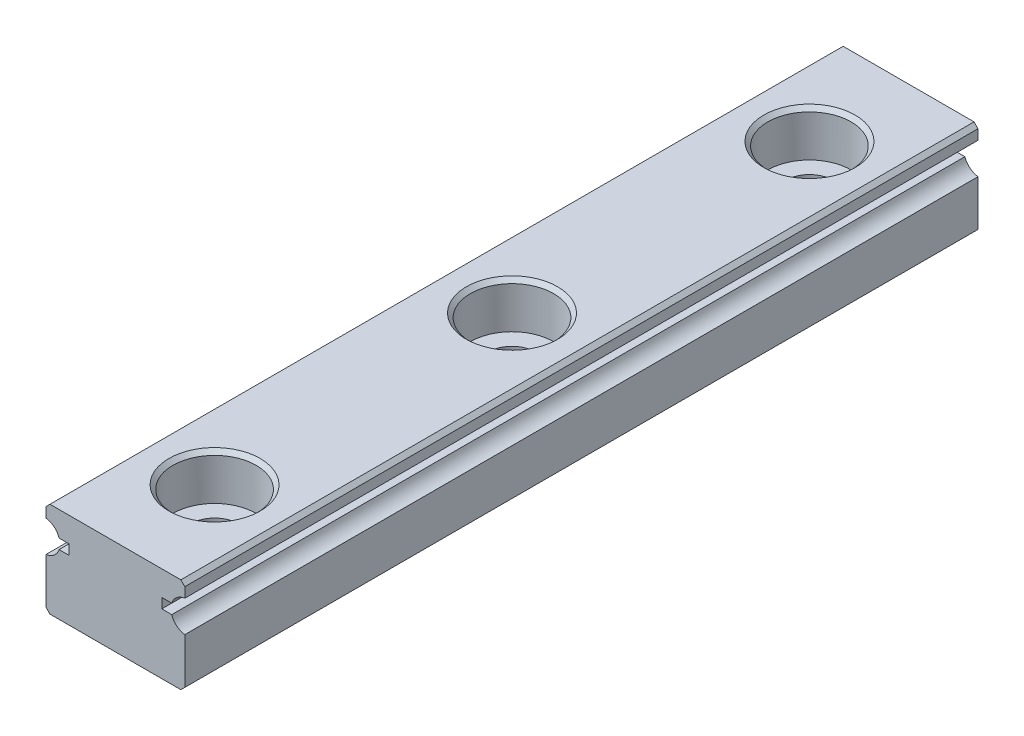
ISO-10303-21;
HEADER;
FILE_DESCRIPTION(('STEP AP214'),'2;1');
FILE_NAME('part.step','',(''),(''),'','','');
FILE_SCHEMA(('AUTOMOTIVE_DESIGN { 1 0 10303 214 1 1 1 1 }'));
ENDSEC;
DATA;
#1=APPLICATION_CONTEXT('core data for automotive mechanical design processes');
#2=APPLICATION_PROTOCOL_DEFINITION('international standard','automotive_design',2000,#1);
#3=PRODUCT_CONTEXT('',#1,'mechanical');
#4=PRODUCT('Part','Part','',(#3));
#5=PRODUCT_RELATED_PRODUCT_CATEGORY('part','',(#4));
#6=PRODUCT_DEFINITION_FORMATION('','',#4);
#7=PRODUCT_DEFINITION_CONTEXT('part definition',#1,'design');
#8=PRODUCT_DEFINITION('design','',#6,#7);
#9=PRODUCT_DEFINITION_SHAPE('','',#8);
#10=(LENGTH_UNIT() NAMED_UNIT(*) SI_UNIT(.MILLI.,.METRE.));
#11=(NAMED_UNIT(*) PLANE_ANGLE_UNIT() SI_UNIT($,.RADIAN.));
#12=(NAMED_UNIT(*) SI_UNIT($,.STERADIAN.) SOLID_ANGLE_UNIT());
#13=UNCERTAINTY_MEASURE_WITH_UNIT(LENGTH_MEASURE(1.E-05),#10,'distance_accuracy_value','');
#14=(GEOMETRIC_REPRESENTATION_CONTEXT(3) GLOBAL_UNCERTAINTY_ASSIGNED_CONTEXT((#13)) GLOBAL_UNIT_ASSIGNED_CONTEXT((#10,
#11,#12)) REPRESENTATION_CONTEXT('',''));
#15=CARTESIAN_POINT('',(0.,0.,0.));
#16=DIRECTION('',(0.,0.,1.));
#17=DIRECTION('',(1.,0.,0.));
#18=AXIS2_PLACEMENT_3D('',#15,#16,#17);
#19=CARTESIAN_POINT('',(0.,-2.401,35.));
#20=DIRECTION('',(0.,1.,0.));
#21=DIRECTION('',(0.,0.,1.));
#22=AXIS2_PLACEMENT_3D('',#19,#20,#21);
#23=CYLINDRICAL_SURFACE('',#22,1.2);
#24=CARTESIAN_POINT('',(0.,-2.20000000000001,35.));
#25=DIRECTION('',(0.,1.,0.));
#26=DIRECTION('',(0.,0.,1.));
#27=AXIS2_PLACEMENT_3D('',#24,#25,#26);
#28=CIRCLE('',#27,1.2);
#29=CARTESIAN_POINT('',(0.,-2.20000000000001,36.2));
#30=VERTEX_POINT('',#29);
#31=EDGE_CURVE('E375',#30,#30,#28,.F.);
#32=ORIENTED_EDGE('',*,*,#31,.T.);
#33=EDGE_LOOP('',(#32));
#34=FACE_BOUND('',#33,.T.);
#35=CARTESIAN_POINT('',(0.,0.0999999999999994,35.));
#36=DIRECTION('',(0.,1.,0.));
#37=DIRECTION('',(0.,0.,1.));
#38=AXIS2_PLACEMENT_3D('',#35,#36,#37);
#39=CIRCLE('',#38,1.2);
#40=CARTESIAN_POINT('',(0.,0.0999999999999994,36.2));
#41=VERTEX_POINT('',#40);
#42=EDGE_CURVE('E648',#41,#41,#39,.T.);
#43=ORIENTED_EDGE('',*,*,#42,.T.);
#44=EDGE_LOOP('',(#43));
#45=FACE_BOUND('',#44,.T.);
#46=ADVANCED_FACE('F39',(#34,#45),#23,.F.);
#47=CARTESIAN_POINT('',(0.,-2.401,20.));
#48=DIRECTION('',(0.,1.,0.));
#49=DIRECTION('',(0.,0.,1.));
#50=AXIS2_PLACEMENT_3D('',#47,#48,#49);
#51=CYLINDRICAL_SURFACE('',#50,1.2);
#52=CARTESIAN_POINT('',(0.,-2.20000000000001,20.));
#53=DIRECTION('',(0.,1.,0.));
#54=DIRECTION('',(0.,0.,1.));
#55=AXIS2_PLACEMENT_3D('',#52,#53,#54);
#56=CIRCLE('',#55,1.2);
#57=CARTESIAN_POINT('',(0.,-2.20000000000001,21.2));
#58=VERTEX_POINT('',#57);
#59=EDGE_CURVE('E359',#58,#58,#56,.F.);
#60=ORIENTED_EDGE('',*,*,#59,.T.);
#61=EDGE_LOOP('',(#60));
#62=FACE_BOUND('',#61,.T.);
#63=CARTESIAN_POINT('',(0.,0.0999999999999994,20.));
#64=DIRECTION('',(0.,1.,0.));
#65=DIRECTION('',(0.,0.,1.));
#66=AXIS2_PLACEMENT_3D('',#63,#64,#65);
#67=CIRCLE('',#66,1.2);
#68=CARTESIAN_POINT('',(0.,0.0999999999999994,21.2));
#69=VERTEX_POINT('',#68);
#70=EDGE_CURVE('E535',#69,#69,#67,.T.);
#71=ORIENTED_EDGE('',*,*,#70,.T.);
#72=EDGE_LOOP('',(#71));
#73=FACE_BOUND('',#72,.T.);
#74=ADVANCED_FACE('F399',(#62,#73),#51,.F.);
#75=CARTESIAN_POINT('',(0.,-2.401,5.));
#76=DIRECTION('',(0.,1.,0.));
#77=DIRECTION('',(0.,0.,1.));
#78=AXIS2_PLACEMENT_3D('',#75,#76,#77);
#79=CYLINDRICAL_SURFACE('',#78,1.2);
#80=CARTESIAN_POINT('',(0.,-2.20000000000001,5.));
#81=DIRECTION('',(0.,1.,0.));
#82=DIRECTION('',(0.,0.,1.));
#83=AXIS2_PLACEMENT_3D('',#80,#81,#82);
#84=CIRCLE('',#83,1.2);
#85=CARTESIAN_POINT('',(0.,-2.20000000000001,6.2));
#86=VERTEX_POINT('',#85);
#87=EDGE_CURVE('E343',#86,#86,#84,.F.);
#88=ORIENTED_EDGE('',*,*,#87,.T.);
#89=EDGE_LOOP('',(#88));
#90=FACE_BOUND('',#89,.T.);
#91=CARTESIAN_POINT('',(0.,0.0999999999999994,5.));
#92=DIRECTION('',(0.,1.,0.));
#93=DIRECTION('',(0.,0.,1.));
#94=AXIS2_PLACEMENT_3D('',#91,#92,#93);
#95=CIRCLE('',#94,1.2);
#96=CARTESIAN_POINT('',(0.,0.0999999999999994,6.2));
#97=VERTEX_POINT('',#96);
#98=EDGE_CURVE('E534',#97,#97,#95,.T.);
#99=ORIENTED_EDGE('',*,*,#98,.T.);
#100=EDGE_LOOP('',(#99));
#101=FACE_BOUND('',#100,.T.);
#102=ADVANCED_FACE('F405',(#90,#101),#79,.F.);
#103=CARTESIAN_POINT('',(-3.6,0.899999999999999,40.));
#104=DIRECTION('',(0.,0.,-1.));
#105=DIRECTION('',(-1.,0.,0.));
#106=AXIS2_PLACEMENT_3D('',#103,#104,#105);
#107=CYLINDRICAL_SURFACE('',#106,0.800000000000001);
#108=CARTESIAN_POINT('',(-3.6,0.899999999999999,0.));
#109=DIRECTION('',(0.,0.,-1.));
#110=DIRECTION('',(-1.,0.,0.));
#111=AXIS2_PLACEMENT_3D('',#108,#109,#110);
#112=CIRCLE('',#111,0.800000000000001);
#113=CARTESIAN_POINT('',(-3.5,1.69372539331938,0.));
#114=VERTEX_POINT('',#113);
#115=CARTESIAN_POINT('',(-2.84006579232147,1.15,0.));
#116=VERTEX_POINT('',#115);
#117=EDGE_CURVE('E214',#114,#116,#112,.T.);
#118=ORIENTED_EDGE('',*,*,#117,.T.);
#119=DIRECTION('',(0.,0.,-1.));
#120=VECTOR('',#119,1.);
#121=CARTESIAN_POINT('',(-2.84006579232147,1.15,40.));
#122=LINE('',#121,#120);
#123=CARTESIAN_POINT('',(-2.84006579232147,1.15,40.));
#124=VERTEX_POINT('',#123);
#125=EDGE_CURVE('E340',#124,#116,#122,.T.);
#126=ORIENTED_EDGE('',*,*,#125,.F.);
#127=CARTESIAN_POINT('',(-3.6,0.899999999999999,40.));
#128=DIRECTION('',(0.,0.,-1.));
#129=DIRECTION('',(-1.,0.,0.));
#130=AXIS2_PLACEMENT_3D('',#127,#128,#129);
#131=CIRCLE('',#130,0.800000000000001);
#132=CARTESIAN_POINT('',(-3.5,1.69372539331938,40.));
#133=VERTEX_POINT('',#132);
#134=EDGE_CURVE('E273',#133,#124,#131,.T.);
#135=ORIENTED_EDGE('',*,*,#134,.F.);
#136=DIRECTION('',(0.,0.,-1.));
#137=VECTOR('',#136,1.);
#138=CARTESIAN_POINT('',(-3.5,1.69372539331938,40.));
#139=LINE('',#138,#137);
#140=EDGE_CURVE('E210',#133,#114,#139,.T.);
#141=ORIENTED_EDGE('',*,*,#140,.T.);
#142=EDGE_LOOP('',(#118,#126,#135,#141));
#143=FACE_BOUND('',#142,.T.);
#144=ADVANCED_FACE('F425',(#143),#107,.F.);
#145=CARTESIAN_POINT('',(-2.84006579232147,1.15,40.));
#146=DIRECTION('',(0.,1.,0.));
#147=DIRECTION('',(-1.,0.,0.));
#148=AXIS2_PLACEMENT_3D('',#145,#146,#147);
#149=PLANE('',#148);
#150=DIRECTION('',(1.,0.,0.));
#151=VECTOR('',#150,1.);
#152=CARTESIAN_POINT('',(-2.84006579232147,1.15,0.));
#153=LINE('',#152,#151);
#154=CARTESIAN_POINT('',(-2.34006579232147,1.15,0.));
#155=VERTEX_POINT('',#154);
#156=EDGE_CURVE('E218',#116,#155,#153,.T.);
#157=ORIENTED_EDGE('',*,*,#156,.T.);
#158=DIRECTION('',(0.,0.,-1.));
#159=VECTOR('',#158,1.);
#160=CARTESIAN_POINT('',(-2.34006579232147,1.15,40.));
#161=LINE('',#160,#159);
#162=CARTESIAN_POINT('',(-2.34006579232147,1.15,40.));
#163=VERTEX_POINT('',#162);
#164=EDGE_CURVE('E336',#163,#155,#161,.T.);
#165=ORIENTED_EDGE('',*,*,#164,.F.);
#166=DIRECTION('',(1.,0.,0.));
#167=VECTOR('',#166,1.);
#168=CARTESIAN_POINT('',(-2.84006579232147,1.15,40.));
#169=LINE('',#168,#167);
#170=EDGE_CURVE('E137',#124,#163,#169,.T.);
#171=ORIENTED_EDGE('',*,*,#170,.F.);
#172=ORIENTED_EDGE('',*,*,#125,.T.);
#173=EDGE_LOOP('',(#157,#165,#171,#172));
#174=FACE_BOUND('',#173,.T.);
#175=ADVANCED_FACE('F499',(#174),#149,.F.);
#176=CARTESIAN_POINT('',(-2.34006579232147,0.649999999999998,40.));
#177=DIRECTION('',(1.,0.,0.));
#178=DIRECTION('',(0.,0.,-1.));
#179=AXIS2_PLACEMENT_3D('',#176,#177,#178);
#180=PLANE('',#179);
#181=DIRECTION('',(0.,-1.,0.));
#182=VECTOR('',#181,1.);
#183=CARTESIAN_POINT('',(-2.34006579232147,0.649999999999998,0.));
#184=LINE('',#183,#182);
#185=CARTESIAN_POINT('',(-2.34006579232147,0.649999999999998,0.));
#186=VERTEX_POINT('',#185);
#187=EDGE_CURVE('E222',#155,#186,#184,.T.);
#188=ORIENTED_EDGE('',*,*,#187,.T.);
#189=DIRECTION('',(0.,0.,-1.));
#190=VECTOR('',#189,1.);
#191=CARTESIAN_POINT('',(-2.34006579232147,0.649999999999998,40.));
#192=LINE('',#191,#190);
#193=CARTESIAN_POINT('',(-2.34006579232147,0.649999999999998,40.));
#194=VERTEX_POINT('',#193);
#195=EDGE_CURVE('E332',#194,#186,#192,.T.);
#196=ORIENTED_EDGE('',*,*,#195,.F.);
#197=DIRECTION('',(0.,-1.,0.));
#198=VECTOR('',#197,1.);
#199=CARTESIAN_POINT('',(-2.34006579232147,0.649999999999998,40.));
#200=LINE('',#199,#198);
#201=EDGE_CURVE('E553',#163,#194,#200,.T.);
#202=ORIENTED_EDGE('',*,*,#201,.F.);
#203=ORIENTED_EDGE('',*,*,#164,.T.);
#204=EDGE_LOOP('',(#188,#196,#202,#203));
#205=FACE_BOUND('',#204,.T.);
#206=ADVANCED_FACE('F495',(#205),#180,.F.);
#207=CARTESIAN_POINT('',(-2.84006579232147,0.649999999999999,40.));
#208=DIRECTION('',(0.,-1.,0.));
#209=DIRECTION('',(1.,0.,0.));
#210=AXIS2_PLACEMENT_3D('',#207,#208,#209);
#211=PLANE('',#210);
#212=DIRECTION('',(-1.,0.,0.));
#213=VECTOR('',#212,1.);
#214=CARTESIAN_POINT('',(-2.84006579232147,0.649999999999999,0.));
#215=LINE('',#214,#213);
#216=CARTESIAN_POINT('',(-2.84006579232147,0.65,0.));
#217=VERTEX_POINT('',#216);
#218=EDGE_CURVE('E225',#186,#217,#215,.T.);
#219=ORIENTED_EDGE('',*,*,#218,.T.);
#220=DIRECTION('',(0.,0.,-1.));
#221=VECTOR('',#220,1.);
#222=CARTESIAN_POINT('',(-2.84006579232147,0.65,40.));
#223=LINE('',#222,#221);
#224=CARTESIAN_POINT('',(-2.84006579232147,0.65,40.));
#225=VERTEX_POINT('',#224);
#226=EDGE_CURVE('E328',#225,#217,#223,.T.);
#227=ORIENTED_EDGE('',*,*,#226,.F.);
#228=DIRECTION('',(-1.,0.,0.));
#229=VECTOR('',#228,1.);
#230=CARTESIAN_POINT('',(-2.84006579232147,0.649999999999999,40.));
#231=LINE('',#230,#229);
#232=EDGE_CURVE('E556',#194,#225,#231,.T.);
#233=ORIENTED_EDGE('',*,*,#232,.F.);
#234=ORIENTED_EDGE('',*,*,#195,.T.);
#235=EDGE_LOOP('',(#219,#227,#233,#234));
#236=FACE_BOUND('',#235,.T.);
#237=ADVANCED_FACE('F491',(#236),#211,.F.);
#238=CARTESIAN_POINT('',(-3.6,0.899999999999999,40.));
#239=DIRECTION('',(0.,0.,-1.));
#240=DIRECTION('',(-1.,0.,0.));
#241=AXIS2_PLACEMENT_3D('',#238,#239,#240);
#242=CYLINDRICAL_SURFACE('',#241,0.800000000000001);
#243=CARTESIAN_POINT('',(-3.6,0.899999999999999,0.));
#244=DIRECTION('',(0.,0.,-1.));
#245=DIRECTION('',(-1.,0.,0.));
#246=AXIS2_PLACEMENT_3D('',#243,#244,#245);
#247=CIRCLE('',#246,0.800000000000001);
#248=CARTESIAN_POINT('',(-3.5,0.106274606680622,0.));
#249=VERTEX_POINT('',#248);
#250=EDGE_CURVE('E228',#217,#249,#247,.T.);
#251=ORIENTED_EDGE('',*,*,#250,.T.);
#252=DIRECTION('',(0.,0.,-1.));
#253=VECTOR('',#252,1.);
#254=CARTESIAN_POINT('',(-3.5,0.106274606680622,40.));
#255=LINE('',#254,#253);
#256=CARTESIAN_POINT('',(-3.5,0.106274606680622,40.));
#257=VERTEX_POINT('',#256);
#258=EDGE_CURVE('E324',#257,#249,#255,.T.);
#259=ORIENTED_EDGE('',*,*,#258,.F.);
#260=CARTESIAN_POINT('',(-3.6,0.899999999999999,40.));
#261=DIRECTION('',(0.,0.,-1.));
#262=DIRECTION('',(-1.,0.,0.));
#263=AXIS2_PLACEMENT_3D('',#260,#261,#262);
#264=CIRCLE('',#263,0.800000000000001);
#265=EDGE_CURVE('E559',#225,#257,#264,.T.);
#266=ORIENTED_EDGE('',*,*,#265,.F.);
#267=ORIENTED_EDGE('',*,*,#226,.T.);
#268=EDGE_LOOP('',(#251,#259,#266,#267));
#269=FACE_BOUND('',#268,.T.);
#270=ADVANCED_FACE('F487',(#269),#242,.F.);
#271=CARTESIAN_POINT('',(-3.5,-2.2,40.));
#272=DIRECTION('',(1.,0.,0.));
#273=DIRECTION('',(0.,1.,0.));
#274=AXIS2_PLACEMENT_3D('',#271,#272,#273);
#275=PLANE('',#274);
#276=DIRECTION('',(0.,-1.,0.));
#277=VECTOR('',#276,1.);
#278=CARTESIAN_POINT('',(-3.5,-2.2,0.));
#279=LINE('',#278,#277);
#280=CARTESIAN_POINT('',(-3.5,-2.2,0.));
#281=VERTEX_POINT('',#280);
#282=EDGE_CURVE('E231',#249,#281,#279,.T.);
#283=ORIENTED_EDGE('',*,*,#282,.T.);
#284=DIRECTION('',(0.,0.,-1.));
#285=VECTOR('',#284,1.);
#286=CARTESIAN_POINT('',(-3.5,-2.2,40.));
#287=LINE('',#286,#285);
#288=CARTESIAN_POINT('',(-3.5,-2.2,40.));
#289=VERTEX_POINT('',#288);
#290=EDGE_CURVE('E320',#289,#281,#287,.T.);
#291=ORIENTED_EDGE('',*,*,#290,.F.);
#292=DIRECTION('',(0.,-1.,0.));
#293=VECTOR('',#292,1.);
#294=CARTESIAN_POINT('',(-3.5,-2.2,40.));
#295=LINE('',#294,#293);
#296=EDGE_CURVE('E562',#257,#289,#295,.T.);
#297=ORIENTED_EDGE('',*,*,#296,.F.);
#298=ORIENTED_EDGE('',*,*,#258,.T.);
#299=EDGE_LOOP('',(#283,#291,#297,#298));
#300=FACE_BOUND('',#299,.T.);
#301=ADVANCED_FACE('F483',(#300),#275,.F.);
#302=CARTESIAN_POINT('',(-3.5,-2.2,40.));
#303=DIRECTION('',(0.707106781186548,0.707106781186548,0.));
#304=DIRECTION('',(-0.707106781186548,0.707106781186548,0.));
#305=AXIS2_PLACEMENT_3D('',#302,#303,#304);
#306=PLANE('',#305);
#307=DIRECTION('',(0.707106781186548,-0.707106781186548,0.));
#308=VECTOR('',#307,1.);
#309=CARTESIAN_POINT('',(-3.5,-2.2,0.));
#310=LINE('',#309,#308);
#311=CARTESIAN_POINT('',(-3.3,-2.4,0.));
#312=VERTEX_POINT('',#311);
#313=EDGE_CURVE('E234',#281,#312,#310,.T.);
#314=ORIENTED_EDGE('',*,*,#313,.T.);
#315=DIRECTION('',(0.,0.,-1.));
#316=VECTOR('',#315,1.);
#317=CARTESIAN_POINT('',(-3.3,-2.4,40.));
#318=LINE('',#317,#316);
#319=CARTESIAN_POINT('',(-3.3,-2.4,40.));
#320=VERTEX_POINT('',#319);
#321=EDGE_CURVE('E316',#320,#312,#318,.T.);
#322=ORIENTED_EDGE('',*,*,#321,.F.);
#323=DIRECTION('',(0.707106781186548,-0.707106781186548,0.));
#324=VECTOR('',#323,1.);
#325=CARTESIAN_POINT('',(-3.5,-2.2,40.));
#326=LINE('',#325,#324);
#327=EDGE_CURVE('E565',#289,#320,#326,.T.);
#328=ORIENTED_EDGE('',*,*,#327,.F.);
#329=ORIENTED_EDGE('',*,*,#290,.T.);
#330=EDGE_LOOP('',(#314,#322,#328,#329));
#331=FACE_BOUND('',#330,.T.);
#332=ADVANCED_FACE('F479',(#331),#306,.F.);
#333=CARTESIAN_POINT('',(-3.3,-2.4,40.));
#334=DIRECTION('',(0.,1.,0.));
#335=DIRECTION('',(0.,0.,1.));
#336=AXIS2_PLACEMENT_3D('',#333,#334,#335);
#337=PLANE('',#336);
#338=CARTESIAN_POINT('',(0.,-2.4,35.));
#339=DIRECTION('',(0.,1.,0.));
#340=DIRECTION('',(0.,0.,1.));
#341=AXIS2_PLACEMENT_3D('',#338,#339,#340);
#342=CIRCLE('',#341,1.39999999999998);
#343=CARTESIAN_POINT('',(0.,-2.4,36.4));
#344=VERTEX_POINT('',#343);
#345=EDGE_CURVE('E379',#344,#344,#342,.T.);
#346=ORIENTED_EDGE('',*,*,#345,.T.);
#347=EDGE_LOOP('',(#346));
#348=FACE_BOUND('',#347,.T.);
#349=CARTESIAN_POINT('',(0.,-2.4,20.));
#350=DIRECTION('',(0.,1.,0.));
#351=DIRECTION('',(0.,0.,1.));
#352=AXIS2_PLACEMENT_3D('',#349,#350,#351);
#353=CIRCLE('',#352,1.39999999999999);
#354=CARTESIAN_POINT('',(0.,-2.4,21.4));
#355=VERTEX_POINT('',#354);
#356=EDGE_CURVE('E363',#355,#355,#353,.T.);
#357=ORIENTED_EDGE('',*,*,#356,.T.);
#358=EDGE_LOOP('',(#357));
#359=FACE_BOUND('',#358,.T.);
#360=CARTESIAN_POINT('',(0.,-2.4,5.));
#361=DIRECTION('',(0.,1.,0.));
#362=DIRECTION('',(0.,0.,1.));
#363=AXIS2_PLACEMENT_3D('',#360,#361,#362);
#364=CIRCLE('',#363,1.39999999999999);
#365=CARTESIAN_POINT('',(0.,-2.4,6.39999999999999));
#366=VERTEX_POINT('',#365);
#367=EDGE_CURVE('E347',#366,#366,#364,.T.);
#368=ORIENTED_EDGE('',*,*,#367,.T.);
#369=EDGE_LOOP('',(#368));
#370=FACE_BOUND('',#369,.T.);
#371=DIRECTION('',(1.,0.,0.));
#372=VECTOR('',#371,1.);
#373=CARTESIAN_POINT('',(-3.3,-2.4,0.));
#374=LINE('',#373,#372);
#375=CARTESIAN_POINT('',(3.3,-2.4,0.));
#376=VERTEX_POINT('',#375);
#377=EDGE_CURVE('E237',#312,#376,#374,.T.);
#378=ORIENTED_EDGE('',*,*,#377,.T.);
#379=DIRECTION('',(0.,0.,-1.));
#380=VECTOR('',#379,1.);
#381=CARTESIAN_POINT('',(3.3,-2.4,40.));
#382=LINE('',#381,#380);
#383=CARTESIAN_POINT('',(3.3,-2.4,40.));
#384=VERTEX_POINT('',#383);
#385=EDGE_CURVE('E312',#384,#376,#382,.T.);
#386=ORIENTED_EDGE('',*,*,#385,.F.);
#387=DIRECTION('',(1.,0.,0.));
#388=VECTOR('',#387,1.);
#389=CARTESIAN_POINT('',(-3.3,-2.4,40.));
#390=LINE('',#389,#388);
#391=EDGE_CURVE('E568',#320,#384,#390,.T.);
#392=ORIENTED_EDGE('',*,*,#391,.F.);
#393=ORIENTED_EDGE('',*,*,#321,.T.);
#394=EDGE_LOOP('',(#378,#386,#392,#393));
#395=FACE_BOUND('',#394,.T.);
#396=ADVANCED_FACE('F475',(#348,#359,#370,#395),#337,.F.);
#397=CARTESIAN_POINT('',(3.3,-2.4,40.));
#398=DIRECTION('',(-0.707106781186548,0.707106781186548,0.));
#399=DIRECTION('',(-0.707106781186548,-0.707106781186548,0.));
#400=AXIS2_PLACEMENT_3D('',#397,#398,#399);
#401=PLANE('',#400);
#402=DIRECTION('',(0.707106781186548,0.707106781186548,0.));
#403=VECTOR('',#402,1.);
#404=CARTESIAN_POINT('',(3.3,-2.4,0.));
#405=LINE('',#404,#403);
#406=CARTESIAN_POINT('',(3.5,-2.2,0.));
#407=VERTEX_POINT('',#406);
#408=EDGE_CURVE('E240',#376,#407,#405,.T.);
#409=ORIENTED_EDGE('',*,*,#408,.T.);
#410=DIRECTION('',(0.,0.,-1.));
#411=VECTOR('',#410,1.);
#412=CARTESIAN_POINT('',(3.5,-2.2,40.));
#413=LINE('',#412,#411);
#414=CARTESIAN_POINT('',(3.5,-2.2,40.));
#415=VERTEX_POINT('',#414);
#416=EDGE_CURVE('E308',#415,#407,#413,.T.);
#417=ORIENTED_EDGE('',*,*,#416,.F.);
#418=DIRECTION('',(0.707106781186548,0.707106781186548,0.));
#419=VECTOR('',#418,1.);
#420=CARTESIAN_POINT('',(3.3,-2.4,40.));
#421=LINE('',#420,#419);
#422=EDGE_CURVE('E571',#384,#415,#421,.T.);
#423=ORIENTED_EDGE('',*,*,#422,.F.);
#424=ORIENTED_EDGE('',*,*,#385,.T.);
#425=EDGE_LOOP('',(#409,#417,#423,#424));
#426=FACE_BOUND('',#425,.T.);
#427=ADVANCED_FACE('F471',(#426),#401,.F.);
#428=CARTESIAN_POINT('',(3.5,-2.2,40.));
#429=DIRECTION('',(-1.,0.,0.));
#430=DIRECTION('',(0.,-1.,0.));
#431=AXIS2_PLACEMENT_3D('',#428,#429,#430);
#432=PLANE('',#431);
#433=DIRECTION('',(0.,1.,0.));
#434=VECTOR('',#433,1.);
#435=CARTESIAN_POINT('',(3.5,-2.2,0.));
#436=LINE('',#435,#434);
#437=CARTESIAN_POINT('',(3.5,0.106274606680621,0.));
#438=VERTEX_POINT('',#437);
#439=EDGE_CURVE('E243',#407,#438,#436,.T.);
#440=ORIENTED_EDGE('',*,*,#439,.T.);
#441=DIRECTION('',(0.,0.,-1.));
#442=VECTOR('',#441,1.);
#443=CARTESIAN_POINT('',(3.5,0.106274606680621,40.));
#444=LINE('',#443,#442);
#445=CARTESIAN_POINT('',(3.5,0.106274606680621,40.));
#446=VERTEX_POINT('',#445);
#447=EDGE_CURVE('E304',#446,#438,#444,.T.);
#448=ORIENTED_EDGE('',*,*,#447,.F.);
#449=DIRECTION('',(0.,1.,0.));
#450=VECTOR('',#449,1.);
#451=CARTESIAN_POINT('',(3.5,-2.2,40.));
#452=LINE('',#451,#450);
#453=EDGE_CURVE('E574',#415,#446,#452,.T.);
#454=ORIENTED_EDGE('',*,*,#453,.F.);
#455=ORIENTED_EDGE('',*,*,#416,.T.);
#456=EDGE_LOOP('',(#440,#448,#454,#455));
#457=FACE_BOUND('',#456,.T.);
#458=ADVANCED_FACE('F467',(#457),#432,.F.);
#459=CARTESIAN_POINT('',(3.6,0.899999999999999,40.));
#460=DIRECTION('',(0.,0.,-1.));
#461=DIRECTION('',(-1.,0.,0.));
#462=AXIS2_PLACEMENT_3D('',#459,#460,#461);
#463=CYLINDRICAL_SURFACE('',#462,0.800000000000001);
#464=CARTESIAN_POINT('',(3.6,0.899999999999999,0.));
#465=DIRECTION('',(0.,0.,-1.));
#466=DIRECTION('',(1.,0.,0.));
#467=AXIS2_PLACEMENT_3D('',#464,#465,#466);
#468=CIRCLE('',#467,0.800000000000001);
#469=CARTESIAN_POINT('',(2.84006579232146,0.649999999999999,0.));
#470=VERTEX_POINT('',#469);
#471=EDGE_CURVE('E246',#438,#470,#468,.T.);
#472=ORIENTED_EDGE('',*,*,#471,.T.);
#473=DIRECTION('',(0.,0.,-1.));
#474=VECTOR('',#473,1.);
#475=CARTESIAN_POINT('',(2.84006579232146,0.649999999999999,40.));
#476=LINE('',#475,#474);
#477=CARTESIAN_POINT('',(2.84006579232146,0.649999999999999,40.));
#478=VERTEX_POINT('',#477);
#479=EDGE_CURVE('E300',#478,#470,#476,.T.);
#480=ORIENTED_EDGE('',*,*,#479,.F.);
#481=CARTESIAN_POINT('',(3.6,0.899999999999999,40.));
#482=DIRECTION('',(0.,0.,-1.));
#483=DIRECTION('',(1.,0.,0.));
#484=AXIS2_PLACEMENT_3D('',#481,#482,#483);
#485=CIRCLE('',#484,0.800000000000001);
#486=EDGE_CURVE('E577',#446,#478,#485,.T.);
#487=ORIENTED_EDGE('',*,*,#486,.F.);
#488=ORIENTED_EDGE('',*,*,#447,.T.);
#489=EDGE_LOOP('',(#472,#480,#487,#488));
#490=FACE_BOUND('',#489,.T.);
#491=ADVANCED_FACE('F463',(#490),#463,.F.);
#492=CARTESIAN_POINT('',(2.84006579232146,0.649999999999999,40.));
#493=DIRECTION('',(0.,-1.,0.));
#494=DIRECTION('',(1.,0.,0.));
#495=AXIS2_PLACEMENT_3D('',#492,#493,#494);
#496=PLANE('',#495);
#497=DIRECTION('',(-1.,0.,0.));
#498=VECTOR('',#497,1.);
#499=CARTESIAN_POINT('',(2.84006579232146,0.649999999999999,0.));
#500=LINE('',#499,#498);
#501=CARTESIAN_POINT('',(2.34006579232147,0.649999999999998,0.));
#502=VERTEX_POINT('',#501);
#503=EDGE_CURVE('E249',#470,#502,#500,.T.);
#504=ORIENTED_EDGE('',*,*,#503,.T.);
#505=DIRECTION('',(0.,0.,-1.));
#506=VECTOR('',#505,1.);
#507=CARTESIAN_POINT('',(2.34006579232147,0.649999999999998,40.));
#508=LINE('',#507,#506);
#509=CARTESIAN_POINT('',(2.34006579232147,0.649999999999998,40.));
#510=VERTEX_POINT('',#509);
#511=EDGE_CURVE('E296',#510,#502,#508,.T.);
#512=ORIENTED_EDGE('',*,*,#511,.F.);
#513=DIRECTION('',(-1.,0.,0.));
#514=VECTOR('',#513,1.);
#515=CARTESIAN_POINT('',(2.84006579232146,0.649999999999999,40.));
#516=LINE('',#515,#514);
#517=EDGE_CURVE('E580',#478,#510,#516,.T.);
#518=ORIENTED_EDGE('',*,*,#517,.F.);
#519=ORIENTED_EDGE('',*,*,#479,.T.);
#520=EDGE_LOOP('',(#504,#512,#518,#519));
#521=FACE_BOUND('',#520,.T.);
#522=ADVANCED_FACE('F459',(#521),#496,.F.);
#523=CARTESIAN_POINT('',(2.34006579232147,0.649999999999998,40.));
#524=DIRECTION('',(-1.,0.,0.));
#525=DIRECTION('',(0.,0.,1.));
#526=AXIS2_PLACEMENT_3D('',#523,#524,#525);
#527=PLANE('',#526);
#528=DIRECTION('',(0.,1.,0.));
#529=VECTOR('',#528,1.);
#530=CARTESIAN_POINT('',(2.34006579232147,0.649999999999998,0.));
#531=LINE('',#530,#529);
#532=CARTESIAN_POINT('',(2.34006579232147,1.15,0.));
#533=VERTEX_POINT('',#532);
#534=EDGE_CURVE('E252',#502,#533,#531,.T.);
#535=ORIENTED_EDGE('',*,*,#534,.T.);
#536=DIRECTION('',(0.,0.,-1.));
#537=VECTOR('',#536,1.);
#538=CARTESIAN_POINT('',(2.34006579232147,1.15,40.));
#539=LINE('',#538,#537);
#540=CARTESIAN_POINT('',(2.34006579232147,1.15,40.));
#541=VERTEX_POINT('',#540);
#542=EDGE_CURVE('E292',#541,#533,#539,.T.);
#543=ORIENTED_EDGE('',*,*,#542,.F.);
#544=DIRECTION('',(0.,1.,0.));
#545=VECTOR('',#544,1.);
#546=CARTESIAN_POINT('',(2.34006579232147,0.649999999999998,40.));
#547=LINE('',#546,#545);
#548=EDGE_CURVE('E583',#510,#541,#547,.T.);
#549=ORIENTED_EDGE('',*,*,#548,.F.);
#550=ORIENTED_EDGE('',*,*,#511,.T.);
#551=EDGE_LOOP('',(#535,#543,#549,#550));
#552=FACE_BOUND('',#551,.T.);
#553=ADVANCED_FACE('F455',(#552),#527,.F.);
#554=CARTESIAN_POINT('',(2.84006579232146,1.15,40.));
#555=DIRECTION('',(0.,1.,0.));
#556=DIRECTION('',(-1.,0.,0.));
#557=AXIS2_PLACEMENT_3D('',#554,#555,#556);
#558=PLANE('',#557);
#559=DIRECTION('',(1.,0.,0.));
#560=VECTOR('',#559,1.);
#561=CARTESIAN_POINT('',(2.84006579232146,1.15,0.));
#562=LINE('',#561,#560);
#563=CARTESIAN_POINT('',(2.84006579232147,1.15,0.));
#564=VERTEX_POINT('',#563);
#565=EDGE_CURVE('E255',#533,#564,#562,.T.);
#566=ORIENTED_EDGE('',*,*,#565,.T.);
#567=DIRECTION('',(0.,0.,-1.));
#568=VECTOR('',#567,1.);
#569=CARTESIAN_POINT('',(2.84006579232147,1.15,40.));
#570=LINE('',#569,#568);
#571=CARTESIAN_POINT('',(2.84006579232147,1.15,40.));
#572=VERTEX_POINT('',#571);
#573=EDGE_CURVE('E288',#572,#564,#570,.T.);
#574=ORIENTED_EDGE('',*,*,#573,.F.);
#575=DIRECTION('',(1.,0.,0.));
#576=VECTOR('',#575,1.);
#577=CARTESIAN_POINT('',(2.84006579232146,1.15,40.));
#578=LINE('',#577,#576);
#579=EDGE_CURVE('E586',#541,#572,#578,.T.);
#580=ORIENTED_EDGE('',*,*,#579,.F.);
#581=ORIENTED_EDGE('',*,*,#542,.T.);
#582=EDGE_LOOP('',(#566,#574,#580,#581));
#583=FACE_BOUND('',#582,.T.);
#584=ADVANCED_FACE('F451',(#583),#558,.F.);
#585=CARTESIAN_POINT('',(3.6,0.899999999999999,40.));
#586=DIRECTION('',(0.,0.,-1.));
#587=DIRECTION('',(-1.,0.,0.));
#588=AXIS2_PLACEMENT_3D('',#585,#586,#587);
#589=CYLINDRICAL_SURFACE('',#588,0.800000000000001);
#590=CARTESIAN_POINT('',(3.6,0.899999999999999,0.));
#591=DIRECTION('',(0.,0.,-1.));
#592=DIRECTION('',(1.,0.,0.));
#593=AXIS2_PLACEMENT_3D('',#590,#591,#592);
#594=CIRCLE('',#593,0.800000000000001);
#595=CARTESIAN_POINT('',(3.5,1.69372539331938,0.));
#596=VERTEX_POINT('',#595);
#597=EDGE_CURVE('E258',#564,#596,#594,.T.);
#598=ORIENTED_EDGE('',*,*,#597,.T.);
#599=DIRECTION('',(0.,0.,-1.));
#600=VECTOR('',#599,1.);
#601=CARTESIAN_POINT('',(3.5,1.69372539331938,40.));
#602=LINE('',#601,#600);
#603=CARTESIAN_POINT('',(3.5,1.69372539331938,40.));
#604=VERTEX_POINT('',#603);
#605=EDGE_CURVE('E284',#604,#596,#602,.T.);
#606=ORIENTED_EDGE('',*,*,#605,.F.);
#607=CARTESIAN_POINT('',(3.6,0.899999999999999,40.));
#608=DIRECTION('',(0.,0.,-1.));
#609=DIRECTION('',(1.,0.,0.));
#610=AXIS2_PLACEMENT_3D('',#607,#608,#609);
#611=CIRCLE('',#610,0.800000000000001);
#612=EDGE_CURVE('E589',#572,#604,#611,.T.);
#613=ORIENTED_EDGE('',*,*,#612,.F.);
#614=ORIENTED_EDGE('',*,*,#573,.T.);
#615=EDGE_LOOP('',(#598,#606,#613,#614));
#616=FACE_BOUND('',#615,.T.);
#617=ADVANCED_FACE('F447',(#616),#589,.F.);
#618=CARTESIAN_POINT('',(3.5,1.69372539331938,40.));
#619=DIRECTION('',(-1.,0.,0.));
#620=DIRECTION('',(0.,-1.,0.));
#621=AXIS2_PLACEMENT_3D('',#618,#619,#620);
#622=PLANE('',#621);
#623=DIRECTION('',(0.,1.,0.));
#624=VECTOR('',#623,1.);
#625=CARTESIAN_POINT('',(3.5,1.69372539331938,0.));
#626=LINE('',#625,#624);
#627=CARTESIAN_POINT('',(3.5,2.2,0.));
#628=VERTEX_POINT('',#627);
#629=EDGE_CURVE('E261',#596,#628,#626,.T.);
#630=ORIENTED_EDGE('',*,*,#629,.T.);
#631=DIRECTION('',(0.,0.,-1.));
#632=VECTOR('',#631,1.);
#633=CARTESIAN_POINT('',(3.5,2.2,40.));
#634=LINE('',#633,#632);
#635=CARTESIAN_POINT('',(3.5,2.2,40.));
#636=VERTEX_POINT('',#635);
#637=EDGE_CURVE('E280',#636,#628,#634,.T.);
#638=ORIENTED_EDGE('',*,*,#637,.F.);
#639=DIRECTION('',(0.,1.,0.));
#640=VECTOR('',#639,1.);
#641=CARTESIAN_POINT('',(3.5,1.69372539331938,40.));
#642=LINE('',#641,#640);
#643=EDGE_CURVE('E592',#604,#636,#642,.T.);
#644=ORIENTED_EDGE('',*,*,#643,.F.);
#645=ORIENTED_EDGE('',*,*,#605,.T.);
#646=EDGE_LOOP('',(#630,#638,#644,#645));
#647=FACE_BOUND('',#646,.T.);
#648=ADVANCED_FACE('F443',(#647),#622,.F.);
#649=CARTESIAN_POINT('',(3.3,2.4,40.));
#650=DIRECTION('',(-0.707106781186547,-0.707106781186548,0.));
#651=DIRECTION('',(0.707106781186548,-0.707106781186547,0.));
#652=AXIS2_PLACEMENT_3D('',#649,#650,#651);
#653=PLANE('',#652);
#654=DIRECTION('',(-0.707106781186548,0.707106781186547,0.));
#655=VECTOR('',#654,1.);
#656=CARTESIAN_POINT('',(3.3,2.4,0.));
#657=LINE('',#656,#655);
#658=CARTESIAN_POINT('',(3.3,2.4,0.));
#659=VERTEX_POINT('',#658);
#660=EDGE_CURVE('E264',#628,#659,#657,.T.);
#661=ORIENTED_EDGE('',*,*,#660,.T.);
#662=DIRECTION('',(0.,0.,-1.));
#663=VECTOR('',#662,1.);
#664=CARTESIAN_POINT('',(3.3,2.4,40.));
#665=LINE('',#664,#663);
#666=CARTESIAN_POINT('',(3.3,2.4,40.));
#667=VERTEX_POINT('',#666);
#668=EDGE_CURVE('E203',#667,#659,#665,.T.);
#669=ORIENTED_EDGE('',*,*,#668,.F.);
#670=DIRECTION('',(-0.707106781186548,0.707106781186547,0.));
#671=VECTOR('',#670,1.);
#672=CARTESIAN_POINT('',(3.3,2.4,40.));
#673=LINE('',#672,#671);
#674=EDGE_CURVE('E192',#636,#667,#673,.T.);
#675=ORIENTED_EDGE('',*,*,#674,.F.);
#676=ORIENTED_EDGE('',*,*,#637,.T.);
#677=EDGE_LOOP('',(#661,#669,#675,#676));
#678=FACE_BOUND('',#677,.T.);
#679=ADVANCED_FACE('F439',(#678),#653,.F.);
#680=CARTESIAN_POINT('',(-3.3,2.4,40.));
#681=DIRECTION('',(0.,-1.,0.));
#682=DIRECTION('',(0.,0.,-1.));
#683=AXIS2_PLACEMENT_3D('',#680,#681,#682);
#684=PLANE('',#683);
#685=CARTESIAN_POINT('',(0.,2.4,35.));
#686=DIRECTION('',(0.,-1.,0.));
#687=DIRECTION('',(0.,0.,-1.));
#688=AXIS2_PLACEMENT_3D('',#685,#686,#687);
#689=CIRCLE('',#688,2.3);
#690=CARTESIAN_POINT('',(0.,2.4,32.7));
#691=VERTEX_POINT('',#690);
#692=EDGE_CURVE('E11',#691,#691,#689,.T.);
#693=ORIENTED_EDGE('',*,*,#692,.T.);
#694=EDGE_LOOP('',(#693));
#695=FACE_BOUND('',#694,.T.);
#696=CARTESIAN_POINT('',(0.,2.4,20.));
#697=DIRECTION('',(0.,-1.,0.));
#698=DIRECTION('',(0.,0.,-1.));
#699=AXIS2_PLACEMENT_3D('',#696,#697,#698);
#700=CIRCLE('',#699,2.3);
#701=CARTESIAN_POINT('',(0.,2.4,17.7));
#702=VERTEX_POINT('',#701);
#703=EDGE_CURVE('E371',#702,#702,#700,.T.);
#704=ORIENTED_EDGE('',*,*,#703,.T.);
#705=EDGE_LOOP('',(#704));
#706=FACE_BOUND('',#705,.T.);
#707=CARTESIAN_POINT('',(0.,2.4,5.));
#708=DIRECTION('',(0.,-1.,0.));
#709=DIRECTION('',(0.,0.,-1.));
#710=AXIS2_PLACEMENT_3D('',#707,#708,#709);
#711=CIRCLE('',#710,2.3);
#712=CARTESIAN_POINT('',(0.,2.4,2.7));
#713=VERTEX_POINT('',#712);
#714=EDGE_CURVE('E355',#713,#713,#711,.T.);
#715=ORIENTED_EDGE('',*,*,#714,.T.);
#716=EDGE_LOOP('',(#715));
#717=FACE_BOUND('',#716,.T.);
#718=DIRECTION('',(-1.,0.,0.));
#719=VECTOR('',#718,1.);
#720=CARTESIAN_POINT('',(-3.3,2.4,0.));
#721=LINE('',#720,#719);
#722=CARTESIAN_POINT('',(-3.3,2.4,0.));
#723=VERTEX_POINT('',#722);
#724=EDGE_CURVE('E201',#659,#723,#721,.T.);
#725=ORIENTED_EDGE('',*,*,#724,.T.);
#726=DIRECTION('',(0.,0.,-1.));
#727=VECTOR('',#726,1.);
#728=CARTESIAN_POINT('',(-3.3,2.4,40.));
#729=LINE('',#728,#727);
#730=CARTESIAN_POINT('',(-3.3,2.4,40.));
#731=VERTEX_POINT('',#730);
#732=EDGE_CURVE('E198',#731,#723,#729,.T.);
#733=ORIENTED_EDGE('',*,*,#732,.F.);
#734=DIRECTION('',(-1.,0.,0.));
#735=VECTOR('',#734,1.);
#736=CARTESIAN_POINT('',(-3.3,2.4,40.));
#737=LINE('',#736,#735);
#738=EDGE_CURVE('E186',#667,#731,#737,.T.);
#739=ORIENTED_EDGE('',*,*,#738,.F.);
#740=ORIENTED_EDGE('',*,*,#668,.T.);
#741=EDGE_LOOP('',(#725,#733,#739,#740));
#742=FACE_BOUND('',#741,.T.);
#743=ADVANCED_FACE('F199',(#695,#706,#717,#742),#684,.F.);
#744=CARTESIAN_POINT('',(-3.5,2.2,40.));
#745=DIRECTION('',(0.707106781186548,-0.707106781186548,0.));
#746=DIRECTION('',(0.707106781186548,0.707106781186548,0.));
#747=AXIS2_PLACEMENT_3D('',#744,#745,#746);
#748=PLANE('',#747);
#749=DIRECTION('',(-0.707106781186548,-0.707106781186548,0.));
#750=VECTOR('',#749,1.);
#751=CARTESIAN_POINT('',(-3.5,2.2,0.));
#752=LINE('',#751,#750);
#753=CARTESIAN_POINT('',(-3.5,2.2,0.));
#754=VERTEX_POINT('',#753);
#755=EDGE_CURVE('E122',#723,#754,#752,.T.);
#756=ORIENTED_EDGE('',*,*,#755,.T.);
#757=DIRECTION('',(0.,0.,-1.));
#758=VECTOR('',#757,1.);
#759=CARTESIAN_POINT('',(-3.5,2.2,40.));
#760=LINE('',#759,#758);
#761=CARTESIAN_POINT('',(-3.5,2.2,40.));
#762=VERTEX_POINT('',#761);
#763=EDGE_CURVE('E204',#762,#754,#760,.T.);
#764=ORIENTED_EDGE('',*,*,#763,.F.);
#765=DIRECTION('',(-0.707106781186548,-0.707106781186548,0.));
#766=VECTOR('',#765,1.);
#767=CARTESIAN_POINT('',(-3.5,2.2,40.));
#768=LINE('',#767,#766);
#769=EDGE_CURVE('E190',#731,#762,#768,.T.);
#770=ORIENTED_EDGE('',*,*,#769,.F.);
#771=ORIENTED_EDGE('',*,*,#732,.T.);
#772=EDGE_LOOP('',(#756,#764,#770,#771));
#773=FACE_BOUND('',#772,.T.);
#774=ADVANCED_FACE('F206',(#773),#748,.F.);
#775=CARTESIAN_POINT('',(-3.5,1.69372539331938,40.));
#776=DIRECTION('',(1.,0.,0.));
#777=DIRECTION('',(0.,1.,0.));
#778=AXIS2_PLACEMENT_3D('',#775,#776,#777);
#779=PLANE('',#778);
#780=DIRECTION('',(0.,-1.,0.));
#781=VECTOR('',#780,1.);
#782=CARTESIAN_POINT('',(-3.5,1.69372539331938,0.));
#783=LINE('',#782,#781);
#784=EDGE_CURVE('E128',#754,#114,#783,.T.);
#785=ORIENTED_EDGE('',*,*,#784,.T.);
#786=ORIENTED_EDGE('',*,*,#140,.F.);
#787=DIRECTION('',(0.,-1.,0.));
#788=VECTOR('',#787,1.);
#789=CARTESIAN_POINT('',(-3.5,1.69372539331938,40.));
#790=LINE('',#789,#788);
#791=EDGE_CURVE('E57',#762,#133,#790,.T.);
#792=ORIENTED_EDGE('',*,*,#791,.F.);
#793=ORIENTED_EDGE('',*,*,#763,.T.);
#794=EDGE_LOOP('',(#785,#786,#792,#793));
#795=FACE_BOUND('',#794,.T.);
#796=ADVANCED_FACE('F429',(#795),#779,.F.);
#797=CARTESIAN_POINT('',(-3.6,0.899999999999999,40.));
#798=DIRECTION('',(0.,0.,-1.));
#799=DIRECTION('',(-1.,0.,0.));
#800=AXIS2_PLACEMENT_3D('',#797,#798,#799);
#801=PLANE('',#800);
#802=ORIENTED_EDGE('',*,*,#134,.T.);
#803=ORIENTED_EDGE('',*,*,#170,.T.);
#804=ORIENTED_EDGE('',*,*,#201,.T.);
#805=ORIENTED_EDGE('',*,*,#232,.T.);
#806=ORIENTED_EDGE('',*,*,#265,.T.);
#807=ORIENTED_EDGE('',*,*,#296,.T.);
#808=ORIENTED_EDGE('',*,*,#327,.T.);
#809=ORIENTED_EDGE('',*,*,#391,.T.);
#810=ORIENTED_EDGE('',*,*,#422,.T.);
#811=ORIENTED_EDGE('',*,*,#453,.T.);
#812=ORIENTED_EDGE('',*,*,#486,.T.);
#813=ORIENTED_EDGE('',*,*,#517,.T.);
#814=ORIENTED_EDGE('',*,*,#548,.T.);
#815=ORIENTED_EDGE('',*,*,#579,.T.);
#816=ORIENTED_EDGE('',*,*,#612,.T.);
#817=ORIENTED_EDGE('',*,*,#643,.T.);
#818=ORIENTED_EDGE('',*,*,#674,.T.);
#819=ORIENTED_EDGE('',*,*,#738,.T.);
#820=ORIENTED_EDGE('',*,*,#769,.T.);
#821=ORIENTED_EDGE('',*,*,#791,.T.);
#822=EDGE_LOOP('',(#802,#803,#804,#805,#806,#807,#808,#809,#810,#811,#812,#813,#814,#815,#816,
#817,#818,#819,#820,#821));
#823=FACE_BOUND('',#822,.T.);
#824=ADVANCED_FACE('F188',(#823),#801,.F.);
#825=CARTESIAN_POINT('',(-3.6,0.899999999999999,0.));
#826=DIRECTION('',(0.,0.,-1.));
#827=DIRECTION('',(-1.,0.,0.));
#828=AXIS2_PLACEMENT_3D('',#825,#826,#827);
#829=PLANE('',#828);
#830=ORIENTED_EDGE('',*,*,#117,.F.);
#831=ORIENTED_EDGE('',*,*,#784,.F.);
#832=ORIENTED_EDGE('',*,*,#755,.F.);
#833=ORIENTED_EDGE('',*,*,#724,.F.);
#834=ORIENTED_EDGE('',*,*,#660,.F.);
#835=ORIENTED_EDGE('',*,*,#629,.F.);
#836=ORIENTED_EDGE('',*,*,#597,.F.);
#837=ORIENTED_EDGE('',*,*,#565,.F.);
#838=ORIENTED_EDGE('',*,*,#534,.F.);
#839=ORIENTED_EDGE('',*,*,#503,.F.);
#840=ORIENTED_EDGE('',*,*,#471,.F.);
#841=ORIENTED_EDGE('',*,*,#439,.F.);
#842=ORIENTED_EDGE('',*,*,#408,.F.);
#843=ORIENTED_EDGE('',*,*,#377,.F.);
#844=ORIENTED_EDGE('',*,*,#313,.F.);
#845=ORIENTED_EDGE('',*,*,#282,.F.);
#846=ORIENTED_EDGE('',*,*,#250,.F.);
#847=ORIENTED_EDGE('',*,*,#218,.F.);
#848=ORIENTED_EDGE('',*,*,#187,.F.);
#849=ORIENTED_EDGE('',*,*,#156,.F.);
#850=EDGE_LOOP('',(#830,#831,#832,#833,#834,#835,#836,#837,#838,#839,#840,#841,#842,#843,#844,
#845,#846,#847,#848,#849));
#851=FACE_BOUND('',#850,.T.);
#852=ADVANCED_FACE('F421',(#851),#829,.T.);
#853=CARTESIAN_POINT('',(0.,0.0999999999999994,5.));
#854=DIRECTION('',(0.,1.,0.));
#855=DIRECTION('',(0.,0.,1.));
#856=AXIS2_PLACEMENT_3D('',#853,#854,#855);
#857=CYLINDRICAL_SURFACE('',#856,2.1);
#858=CARTESIAN_POINT('',(0.,2.2,5.));
#859=DIRECTION('',(0.,-1.,0.));
#860=DIRECTION('',(0.,0.,-1.));
#861=AXIS2_PLACEMENT_3D('',#858,#859,#860);
#862=CIRCLE('',#861,2.1);
#863=CARTESIAN_POINT('',(0.,2.2,2.9));
#864=VERTEX_POINT('',#863);
#865=EDGE_CURVE('E351',#864,#864,#862,.F.);
#866=ORIENTED_EDGE('',*,*,#865,.T.);
#867=EDGE_LOOP('',(#866));
#868=FACE_BOUND('',#867,.T.);
#869=CARTESIAN_POINT('',(0.,0.0999999999999994,5.));
#870=DIRECTION('',(0.,1.,0.));
#871=DIRECTION('',(0.,0.,1.));
#872=AXIS2_PLACEMENT_3D('',#869,#870,#871);
#873=CIRCLE('',#872,2.1);
#874=CARTESIAN_POINT('',(0.,0.0999999999999994,7.1));
#875=VERTEX_POINT('',#874);
#876=EDGE_CURVE('E219',#875,#875,#873,.T.);
#877=ORIENTED_EDGE('',*,*,#876,.F.);
#878=EDGE_LOOP('',(#877));
#879=FACE_BOUND('',#878,.T.);
#880=ADVANCED_FACE('F417',(#868,#879),#857,.F.);
#881=CARTESIAN_POINT('',(0.,0.0999999999999994,5.));
#882=DIRECTION('',(0.,1.,0.));
#883=DIRECTION('',(0.,0.,1.));
#884=AXIS2_PLACEMENT_3D('',#881,#882,#883);
#885=PLANE('',#884);
#886=ORIENTED_EDGE('',*,*,#98,.F.);
#887=EDGE_LOOP('',(#886));
#888=FACE_BOUND('',#887,.T.);
#889=ORIENTED_EDGE('',*,*,#876,.T.);
#890=EDGE_LOOP('',(#889));
#891=FACE_BOUND('',#890,.T.);
#892=ADVANCED_FACE('F413',(#888,#891),#885,.T.);
#893=CARTESIAN_POINT('',(0.,-2.20000000000001,5.));
#894=DIRECTION('',(0.,-1.,0.));
#895=DIRECTION('',(0.,0.,-1.));
#896=AXIS2_PLACEMENT_3D('',#893,#894,#895);
#897=CONICAL_SURFACE('',#896,1.2,0.785398163397441);
#898=ORIENTED_EDGE('',*,*,#367,.F.);
#899=EDGE_LOOP('',(#898));
#900=FACE_BOUND('',#899,.T.);
#901=ORIENTED_EDGE('',*,*,#87,.F.);
#902=EDGE_LOOP('',(#901));
#903=FACE_BOUND('',#902,.T.);
#904=ADVANCED_FACE('F416',(#900,#903),#897,.F.);
#905=CARTESIAN_POINT('',(0.,2.2,5.));
#906=DIRECTION('',(0.,1.,0.));
#907=DIRECTION('',(0.,0.,1.));
#908=AXIS2_PLACEMENT_3D('',#905,#906,#907);
#909=CONICAL_SURFACE('',#908,2.1,0.785398163397455);
#910=ORIENTED_EDGE('',*,*,#714,.F.);
#911=EDGE_LOOP('',(#910));
#912=FACE_BOUND('',#911,.T.);
#913=ORIENTED_EDGE('',*,*,#865,.F.);
#914=EDGE_LOOP('',(#913));
#915=FACE_BOUND('',#914,.T.);
#916=ADVANCED_FACE('F508',(#912,#915),#909,.F.);
#917=CARTESIAN_POINT('',(0.,0.0999999999999994,20.));
#918=DIRECTION('',(0.,1.,0.));
#919=DIRECTION('',(0.,0.,1.));
#920=AXIS2_PLACEMENT_3D('',#917,#918,#919);
#921=CYLINDRICAL_SURFACE('',#920,2.1);
#922=CARTESIAN_POINT('',(0.,2.2,20.));
#923=DIRECTION('',(0.,-1.,0.));
#924=DIRECTION('',(0.,0.,-1.));
#925=AXIS2_PLACEMENT_3D('',#922,#923,#924);
#926=CIRCLE('',#925,2.1);
#927=CARTESIAN_POINT('',(0.,2.2,17.9));
#928=VERTEX_POINT('',#927);
#929=EDGE_CURVE('E367',#928,#928,#926,.F.);
#930=ORIENTED_EDGE('',*,*,#929,.T.);
#931=EDGE_LOOP('',(#930));
#932=FACE_BOUND('',#931,.T.);
#933=CARTESIAN_POINT('',(0.,0.0999999999999994,20.));
#934=DIRECTION('',(0.,1.,0.));
#935=DIRECTION('',(0.,0.,1.));
#936=AXIS2_PLACEMENT_3D('',#933,#934,#935);
#937=CIRCLE('',#936,2.1);
#938=CARTESIAN_POINT('',(0.,0.0999999999999994,22.1));
#939=VERTEX_POINT('',#938);
#940=EDGE_CURVE('E531',#939,#939,#937,.T.);
#941=ORIENTED_EDGE('',*,*,#940,.F.);
#942=EDGE_LOOP('',(#941));
#943=FACE_BOUND('',#942,.T.);
#944=ADVANCED_FACE('F410',(#932,#943),#921,.F.);
#945=CARTESIAN_POINT('',(0.,0.0999999999999994,20.));
#946=DIRECTION('',(0.,1.,0.));
#947=DIRECTION('',(0.,0.,1.));
#948=AXIS2_PLACEMENT_3D('',#945,#946,#947);
#949=PLANE('',#948);
#950=ORIENTED_EDGE('',*,*,#70,.F.);
#951=EDGE_LOOP('',(#950));
#952=FACE_BOUND('',#951,.T.);
#953=ORIENTED_EDGE('',*,*,#940,.T.);
#954=EDGE_LOOP('',(#953));
#955=FACE_BOUND('',#954,.T.);
#956=ADVANCED_FACE('F528',(#952,#955),#949,.T.);
#957=CARTESIAN_POINT('',(0.,0.0999999999999994,35.));
#958=DIRECTION('',(0.,1.,0.));
#959=DIRECTION('',(0.,0.,1.));
#960=AXIS2_PLACEMENT_3D('',#957,#958,#959);
#961=CYLINDRICAL_SURFACE('',#960,2.1);
#962=CARTESIAN_POINT('',(0.,2.2,35.));
#963=DIRECTION('',(0.,-1.,0.));
#964=DIRECTION('',(0.,0.,-1.));
#965=AXIS2_PLACEMENT_3D('',#962,#963,#964);
#966=CIRCLE('',#965,2.1);
#967=CARTESIAN_POINT('',(0.,2.2,32.9));
#968=VERTEX_POINT('',#967);
#969=EDGE_CURVE('E49',#968,#968,#966,.F.);
#970=ORIENTED_EDGE('',*,*,#969,.T.);
#971=EDGE_LOOP('',(#970));
#972=FACE_BOUND('',#971,.T.);
#973=CARTESIAN_POINT('',(0.,0.0999999999999994,35.));
#974=DIRECTION('',(0.,1.,0.));
#975=DIRECTION('',(0.,0.,1.));
#976=AXIS2_PLACEMENT_3D('',#973,#974,#975);
#977=CIRCLE('',#976,2.1);
#978=CARTESIAN_POINT('',(0.,0.0999999999999994,37.1));
#979=VERTEX_POINT('',#978);
#980=EDGE_CURVE('E542',#979,#979,#977,.T.);
#981=ORIENTED_EDGE('',*,*,#980,.F.);
#982=EDGE_LOOP('',(#981));
#983=FACE_BOUND('',#982,.T.);
#984=ADVANCED_FACE('F386',(#972,#983),#961,.F.);
#985=CARTESIAN_POINT('',(0.,0.0999999999999994,35.));
#986=DIRECTION('',(0.,1.,0.));
#987=DIRECTION('',(0.,0.,1.));
#988=AXIS2_PLACEMENT_3D('',#985,#986,#987);
#989=PLANE('',#988);
#990=ORIENTED_EDGE('',*,*,#42,.F.);
#991=EDGE_LOOP('',(#990));
#992=FACE_BOUND('',#991,.T.);
#993=ORIENTED_EDGE('',*,*,#980,.T.);
#994=EDGE_LOOP('',(#993));
#995=FACE_BOUND('',#994,.T.);
#996=ADVANCED_FACE('F516',(#992,#995),#989,.T.);
#997=CARTESIAN_POINT('',(0.,-2.20000000000001,20.));
#998=DIRECTION('',(0.,-1.,0.));
#999=DIRECTION('',(0.,0.,-1.));
#1000=AXIS2_PLACEMENT_3D('',#997,#998,#999);
#1001=CONICAL_SURFACE('',#1000,1.2,0.785398163397441);
#1002=ORIENTED_EDGE('',*,*,#356,.F.);
#1003=EDGE_LOOP('',(#1002));
#1004=FACE_BOUND('',#1003,.T.);
#1005=ORIENTED_EDGE('',*,*,#59,.F.);
#1006=EDGE_LOOP('',(#1005));
#1007=FACE_BOUND('',#1006,.T.);
#1008=ADVANCED_FACE('F513',(#1004,#1007),#1001,.F.);
#1009=CARTESIAN_POINT('',(0.,2.2,20.));
#1010=DIRECTION('',(0.,1.,0.));
#1011=DIRECTION('',(0.,0.,1.));
#1012=AXIS2_PLACEMENT_3D('',#1009,#1010,#1011);
#1013=CONICAL_SURFACE('',#1012,2.1,0.785398163397455);
#1014=ORIENTED_EDGE('',*,*,#703,.F.);
#1015=EDGE_LOOP('',(#1014));
#1016=FACE_BOUND('',#1015,.T.);
#1017=ORIENTED_EDGE('',*,*,#929,.F.);
#1018=EDGE_LOOP('',(#1017));
#1019=FACE_BOUND('',#1018,.T.);
#1020=ADVANCED_FACE('F395',(#1016,#1019),#1013,.F.);
#1021=CARTESIAN_POINT('',(0.,-2.20000000000001,35.));
#1022=DIRECTION('',(0.,-1.,0.));
#1023=DIRECTION('',(0.,0.,-1.));
#1024=AXIS2_PLACEMENT_3D('',#1021,#1022,#1023);
#1025=CONICAL_SURFACE('',#1024,1.2,0.785398163397432);
#1026=ORIENTED_EDGE('',*,*,#345,.F.);
#1027=EDGE_LOOP('',(#1026));
#1028=FACE_BOUND('',#1027,.T.);
#1029=ORIENTED_EDGE('',*,*,#31,.F.);
#1030=EDGE_LOOP('',(#1029));
#1031=FACE_BOUND('',#1030,.T.);
#1032=ADVANCED_FACE('F390',(#1028,#1031),#1025,.F.);
#1033=CARTESIAN_POINT('',(0.,2.2,35.));
#1034=DIRECTION('',(0.,1.,0.));
#1035=DIRECTION('',(0.,0.,1.));
#1036=AXIS2_PLACEMENT_3D('',#1033,#1034,#1035);
#1037=CONICAL_SURFACE('',#1036,2.1,0.785398163397455);
#1038=ORIENTED_EDGE('',*,*,#692,.F.);
#1039=EDGE_LOOP('',(#1038));
#1040=FACE_BOUND('',#1039,.T.);
#1041=ORIENTED_EDGE('',*,*,#969,.F.);
#1042=EDGE_LOOP('',(#1041));
#1043=FACE_BOUND('',#1042,.T.);
#1044=ADVANCED_FACE('F41',(#1040,#1043),#1037,.F.);
#1045=CLOSED_SHELL('',(#46,#74,#102,#144,#175,#206,#237,#270,#301,#332,#396,#427,#458,#491,#522,
#553,#584,#617,#648,#679,#743,#774,#796,#824,#852,#880,#892,#904,#916,#944,#956,#984,#996,#1008,
#1020,#1032,#1044));
#1046=MANIFOLD_SOLID_BREP('B2',#1045);
#1047=ADVANCED_BREP_SHAPE_REPRESENTATION('',(#18,#1046),#14);
#1048=SHAPE_DEFINITION_REPRESENTATION(#9,#1047);
ENDSEC;
END-ISO-10303-21;
